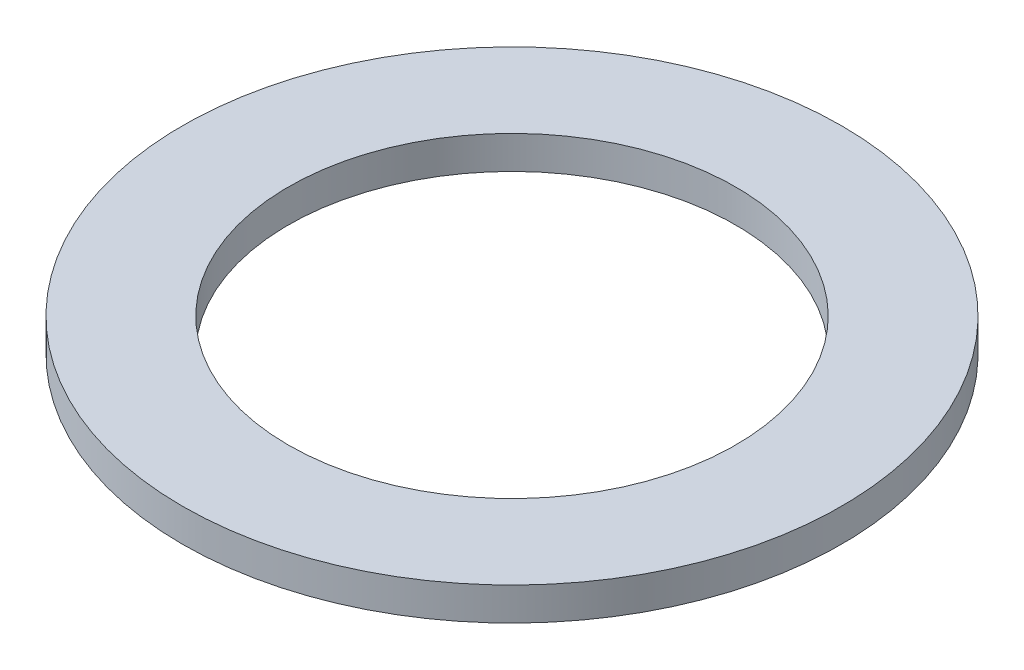
ISO-10303-21;
HEADER;
FILE_DESCRIPTION(('STEP AP214'),'2;1');
FILE_NAME('part.step','',(''),(''),'','','');
FILE_SCHEMA(('AUTOMOTIVE_DESIGN { 1 0 10303 214 1 1 1 1 }'));
ENDSEC;
DATA;
#1=APPLICATION_CONTEXT('core data for automotive mechanical design processes');
#2=APPLICATION_PROTOCOL_DEFINITION('international standard','automotive_design',2000,#1);
#3=PRODUCT_CONTEXT('',#1,'mechanical');
#4=PRODUCT('Part','Part','',(#3));
#5=PRODUCT_RELATED_PRODUCT_CATEGORY('part','',(#4));
#6=PRODUCT_DEFINITION_FORMATION('','',#4);
#7=PRODUCT_DEFINITION_CONTEXT('part definition',#1,'design');
#8=PRODUCT_DEFINITION('design','',#6,#7);
#9=PRODUCT_DEFINITION_SHAPE('','',#8);
#10=(LENGTH_UNIT() NAMED_UNIT(*) SI_UNIT(.MILLI.,.METRE.));
#11=(NAMED_UNIT(*) PLANE_ANGLE_UNIT() SI_UNIT($,.RADIAN.));
#12=(NAMED_UNIT(*) SI_UNIT($,.STERADIAN.) SOLID_ANGLE_UNIT());
#13=UNCERTAINTY_MEASURE_WITH_UNIT(LENGTH_MEASURE(1.E-05),#10,'distance_accuracy_value','');
#14=(GEOMETRIC_REPRESENTATION_CONTEXT(3) GLOBAL_UNCERTAINTY_ASSIGNED_CONTEXT((#13)) GLOBAL_UNIT_ASSIGNED_CONTEXT((#10,
#11,#12)) REPRESENTATION_CONTEXT('',''));
#15=CARTESIAN_POINT('',(0.,0.,0.));
#16=DIRECTION('',(0.,0.,1.));
#17=DIRECTION('',(1.,0.,0.));
#18=AXIS2_PLACEMENT_3D('',#15,#16,#17);
#19=CARTESIAN_POINT('',(0.,7.,0.));
#20=DIRECTION('',(0.,-1.,0.));
#21=DIRECTION('',(0.,0.,-1.));
#22=AXIS2_PLACEMENT_3D('',#19,#20,#21);
#23=CYLINDRICAL_SURFACE('',#22,70.);
#24=CARTESIAN_POINT('',(0.,7.,0.));
#25=DIRECTION('',(0.,1.,0.));
#26=DIRECTION('',(0.,0.,1.));
#27=AXIS2_PLACEMENT_3D('',#24,#25,#26);
#28=CIRCLE('',#27,70.);
#29=CARTESIAN_POINT('',(0.,7.,70.));
#30=VERTEX_POINT('',#29);
#31=EDGE_CURVE('E10',#30,#30,#28,.T.);
#32=ORIENTED_EDGE('',*,*,#31,.F.);
#33=EDGE_LOOP('',(#32));
#34=FACE_BOUND('',#33,.T.);
#35=CARTESIAN_POINT('',(0.,0.,0.));
#36=DIRECTION('',(0.,1.,0.));
#37=DIRECTION('',(0.,0.,1.));
#38=AXIS2_PLACEMENT_3D('',#35,#36,#37);
#39=CIRCLE('',#38,70.);
#40=CARTESIAN_POINT('',(0.,0.,70.));
#41=VERTEX_POINT('',#40);
#42=EDGE_CURVE('E37',#41,#41,#39,.T.);
#43=ORIENTED_EDGE('',*,*,#42,.T.);
#44=EDGE_LOOP('',(#43));
#45=FACE_BOUND('',#44,.T.);
#46=ADVANCED_FACE('F40',(#34,#45),#23,.T.);
#47=CARTESIAN_POINT('',(0.,7.,0.));
#48=DIRECTION('',(0.,1.,0.));
#49=DIRECTION('',(0.,0.,1.));
#50=AXIS2_PLACEMENT_3D('',#47,#48,#49);
#51=PLANE('',#50);
#52=CARTESIAN_POINT('',(0.,7.,0.));
#53=DIRECTION('',(0.,1.,0.));
#54=DIRECTION('',(0.,0.,1.));
#55=AXIS2_PLACEMENT_3D('',#52,#53,#54);
#56=CIRCLE('',#55,47.5);
#57=CARTESIAN_POINT('',(0.,7.,47.5));
#58=VERTEX_POINT('',#57);
#59=EDGE_CURVE('E50',#58,#58,#56,.T.);
#60=ORIENTED_EDGE('',*,*,#59,.F.);
#61=EDGE_LOOP('',(#60));
#62=FACE_BOUND('',#61,.T.);
#63=ORIENTED_EDGE('',*,*,#31,.T.);
#64=EDGE_LOOP('',(#63));
#65=FACE_BOUND('',#64,.T.);
#66=ADVANCED_FACE('F59',(#62,#65),#51,.T.);
#67=CARTESIAN_POINT('',(0.,0.,0.));
#68=DIRECTION('',(0.,1.,0.));
#69=DIRECTION('',(0.,0.,1.));
#70=AXIS2_PLACEMENT_3D('',#67,#68,#69);
#71=PLANE('',#70);
#72=CARTESIAN_POINT('',(0.,0.,0.));
#73=DIRECTION('',(0.,1.,0.));
#74=DIRECTION('',(0.,0.,1.));
#75=AXIS2_PLACEMENT_3D('',#72,#73,#74);
#76=CIRCLE('',#75,47.5);
#77=CARTESIAN_POINT('',(0.,0.,47.5));
#78=VERTEX_POINT('',#77);
#79=EDGE_CURVE('E47',#78,#78,#76,.T.);
#80=ORIENTED_EDGE('',*,*,#79,.T.);
#81=EDGE_LOOP('',(#80));
#82=FACE_BOUND('',#81,.T.);
#83=ORIENTED_EDGE('',*,*,#42,.F.);
#84=EDGE_LOOP('',(#83));
#85=FACE_BOUND('',#84,.T.);
#86=ADVANCED_FACE('F58',(#82,#85),#71,.F.);
#87=CARTESIAN_POINT('',(0.,7.,0.));
#88=DIRECTION('',(0.,-1.,0.));
#89=DIRECTION('',(0.,0.,-1.));
#90=AXIS2_PLACEMENT_3D('',#87,#88,#89);
#91=CYLINDRICAL_SURFACE('',#90,47.5);
#92=ORIENTED_EDGE('',*,*,#59,.T.);
#93=EDGE_LOOP('',(#92));
#94=FACE_BOUND('',#93,.T.);
#95=ORIENTED_EDGE('',*,*,#79,.F.);
#96=EDGE_LOOP('',(#95));
#97=FACE_BOUND('',#96,.T.);
#98=ADVANCED_FACE('F54',(#94,#97),#91,.F.);
#99=CLOSED_SHELL('',(#46,#66,#86,#98));
#100=MANIFOLD_SOLID_BREP('B2',#99);
#101=ADVANCED_BREP_SHAPE_REPRESENTATION('',(#18,#100),#14);
#102=SHAPE_DEFINITION_REPRESENTATION(#9,#101);
ENDSEC;
END-ISO-10303-21;
